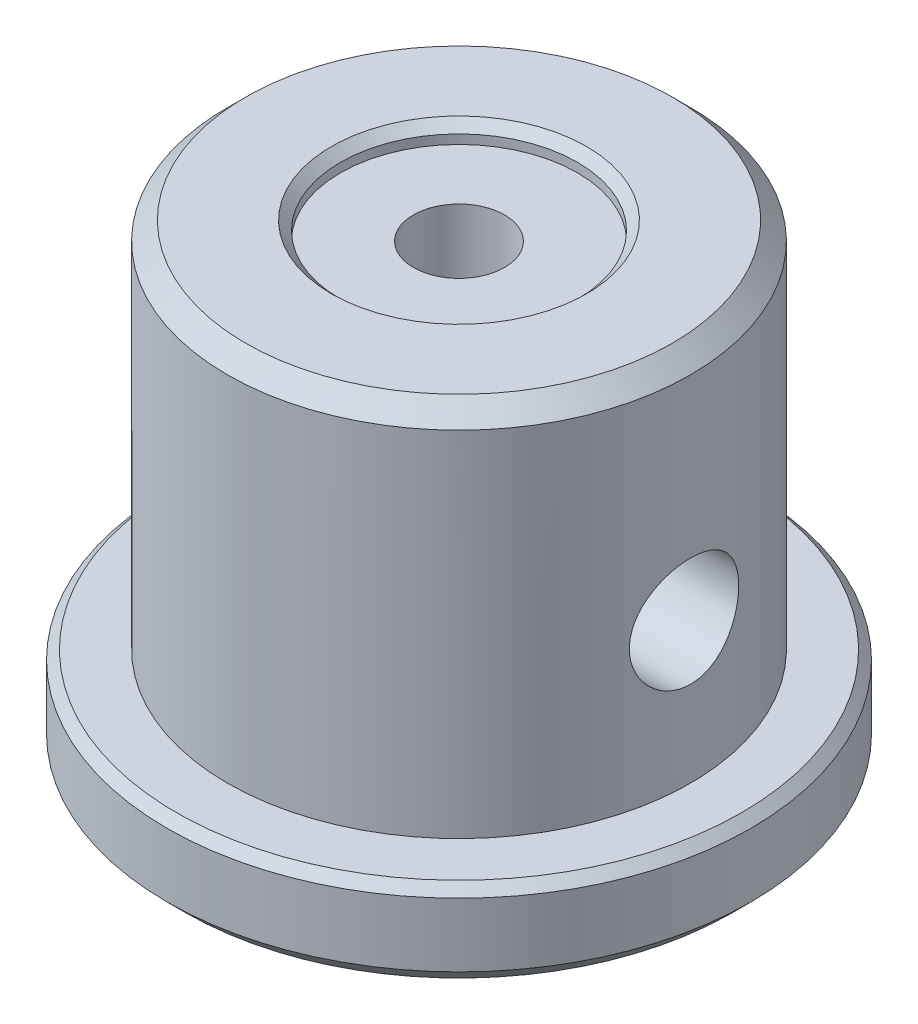
ISO-10303-21;
HEADER;
FILE_DESCRIPTION(('STEP AP214'),'2;1');
FILE_NAME('part.step','',(''),(''),'','','');
FILE_SCHEMA(('AUTOMOTIVE_DESIGN { 1 0 10303 214 1 1 1 1 }'));
ENDSEC;
DATA;
#1=APPLICATION_CONTEXT('core data for automotive mechanical design processes');
#2=APPLICATION_PROTOCOL_DEFINITION('international standard','automotive_design',2000,#1);
#3=PRODUCT_CONTEXT('',#1,'mechanical');
#4=PRODUCT('Part','Part','',(#3));
#5=PRODUCT_RELATED_PRODUCT_CATEGORY('part','',(#4));
#6=PRODUCT_DEFINITION_FORMATION('','',#4);
#7=PRODUCT_DEFINITION_CONTEXT('part definition',#1,'design');
#8=PRODUCT_DEFINITION('design','',#6,#7);
#9=PRODUCT_DEFINITION_SHAPE('','',#8);
#10=(LENGTH_UNIT() NAMED_UNIT(*) SI_UNIT(.MILLI.,.METRE.));
#11=(NAMED_UNIT(*) PLANE_ANGLE_UNIT() SI_UNIT($,.RADIAN.));
#12=(NAMED_UNIT(*) SI_UNIT($,.STERADIAN.) SOLID_ANGLE_UNIT());
#13=UNCERTAINTY_MEASURE_WITH_UNIT(LENGTH_MEASURE(1.E-05),#10,'distance_accuracy_value','');
#14=(GEOMETRIC_REPRESENTATION_CONTEXT(3) GLOBAL_UNCERTAINTY_ASSIGNED_CONTEXT((#13)) GLOBAL_UNIT_ASSIGNED_CONTEXT((#10,
#11,#12)) REPRESENTATION_CONTEXT('',''));
#15=CARTESIAN_POINT('',(0.,0.,0.));
#16=DIRECTION('',(0.,0.,1.));
#17=DIRECTION('',(1.,0.,0.));
#18=AXIS2_PLACEMENT_3D('',#15,#16,#17);
#19=CARTESIAN_POINT('',(0.,-11.7,0.));
#20=DIRECTION('',(0.,-1.,0.));
#21=DIRECTION('',(0.,0.,-1.));
#22=AXIS2_PLACEMENT_3D('',#19,#20,#21);
#23=CYLINDRICAL_SURFACE('',#22,2.5);
#24=CARTESIAN_POINT('',(0.,-1.6583123951777,-2.5));
#25=CARTESIAN_POINT('',(-0.088304410185564,-1.65832848527777,-2.49999381779257));
#26=CARTESIAN_POINT('',(-0.176759786009825,-1.6655210686776,-2.49526266006824));
#27=CARTESIAN_POINT('',(-0.35077788390269,-1.69279627564258,-2.47682990119872));
#28=CARTESIAN_POINT('',(-0.436329599685066,-1.71292318814634,-2.46309747522165));
#29=CARTESIAN_POINT('',(-0.635105310642334,-1.7723311567861,-2.42086856120701));
#30=CARTESIAN_POINT('',(-0.746191654487405,-1.81601359579225,-2.38871146123827));
#31=CARTESIAN_POINT('',(-0.959177816575186,-1.91336767201443,-2.31147102501776));
#32=CARTESIAN_POINT('',(-1.061046484653,-1.96707143083862,-2.26634586338956));
#33=CARTESIAN_POINT('',(-1.22904561401217,-2.0633128033891,-2.1784743531554));
#34=CARTESIAN_POINT('',(-1.29726159135526,-2.10482488185012,-2.1385289521929));
#35=CARTESIAN_POINT('',(-1.42928710039742,-2.18866644492365,-2.05264418187203));
#36=CARTESIAN_POINT('',(-1.49309472073759,-2.23099627404094,-2.00670223718894));
#37=CARTESIAN_POINT('',(-1.6777567676036,-2.35727388143592,-1.86006177209498));
#38=CARTESIAN_POINT('',(-1.79213663242395,-2.44068431676979,-1.75039822318641));
#39=CARTESIAN_POINT('',(-1.97859400578864,-2.58108364411647,-1.53331236095276));
#40=CARTESIAN_POINT('',(-2.05449822257982,-2.63992409122052,-1.43034863494402));
#41=CARTESIAN_POINT('',(-2.1913370573922,-2.74775790284001,-1.2102730649704));
#42=CARTESIAN_POINT('',(-2.25229592151062,-2.79676719280152,-1.0931846025589));
#43=CARTESIAN_POINT('',(-2.34711286507275,-2.8737292379046,-0.867930574105452));
#44=CARTESIAN_POINT('',(-2.38383396465568,-2.90385730730848,-0.761720558967916));
#45=CARTESIAN_POINT('',(-2.44298040968634,-2.9526038261635,-0.542834165009171));
#46=CARTESIAN_POINT('',(-2.46541399390808,-2.97122890852624,-0.430161553726257));
#47=CARTESIAN_POINT('',(-2.49460149564534,-2.99549160197878,-0.200906197669826));
#48=CARTESIAN_POINT('',(-2.50128982974754,-3.00107488956406,-0.0843091426465968));
#49=CARTESIAN_POINT('',(-2.4982977548847,-2.99858143529682,0.148527393661064));
#50=CARTESIAN_POINT('',(-2.48861770853832,-2.99050499605651,0.264766882809716));
#51=CARTESIAN_POINT('',(-2.45478575045629,-2.96241335973365,0.485446031322613));
#52=CARTESIAN_POINT('',(-2.43164888215418,-2.9432359451617,0.590154005534434));
#53=CARTESIAN_POINT('',(-2.37305216876755,-2.89501312358898,0.793626256853986));
#54=CARTESIAN_POINT('',(-2.33759055594486,-2.86596630103235,0.892389678949309));
#55=CARTESIAN_POINT('',(-2.25240882854878,-2.79690305459733,1.09053364635439));
#56=CARTESIAN_POINT('',(-2.20172823083574,-2.7561606192345,1.18924374927733));
#57=CARTESIAN_POINT('',(-2.08960330706299,-2.66744762527376,1.37677917974558));
#58=CARTESIAN_POINT('',(-2.02814930658852,-2.61947057552121,1.46559550453314));
#59=CARTESIAN_POINT('',(-1.86454067552574,-2.4944878939135,1.67280381279727));
#60=CARTESIAN_POINT('',(-1.75692877660215,-2.41452783856826,1.78517417530476));
#61=CARTESIAN_POINT('',(-1.58275969727699,-2.29203945368863,1.93670187620853));
#62=CARTESIAN_POINT('',(-1.522485831693,-2.25072631897241,1.98442734415742));
#63=CARTESIAN_POINT('',(-1.39772821451073,-2.16828375986482,2.07418694298424));
#64=CARTESIAN_POINT('',(-1.33324598900508,-2.12715427459339,2.11622312017878));
#65=CARTESIAN_POINT('',(-1.16888139552588,-2.02736013921577,2.21282833126485));
#66=CARTESIAN_POINT('',(-1.06653640056607,-1.96948181658004,2.26407571910762));
#67=CARTESIAN_POINT('',(-0.852138828462755,-1.86213853666711,2.35314050085765));
#68=CARTESIAN_POINT('',(-0.740114944373146,-1.81264991817824,2.39099600305927));
#69=CARTESIAN_POINT('',(-0.544179547487996,-1.74376607660709,2.4414108954061));
#70=CARTESIAN_POINT('',(-0.463001249716639,-1.71981949257405,2.45819358164965));
#71=CARTESIAN_POINT('',(-0.297038854325257,-1.68277668804568,2.48370273222149));
#72=CARTESIAN_POINT('',(-0.212263731105008,-1.66965496020135,2.49244814091896));
#73=CARTESIAN_POINT('',(-0.0405722934295429,-1.65659310081955,2.50115517387014));
#74=CARTESIAN_POINT('',(0.0463550146674118,-1.65674814862693,2.5010533736449));
#75=CARTESIAN_POINT('',(0.218705687513545,-1.67045143445787,2.49191597272525));
#76=CARTESIAN_POINT('',(0.304126803130151,-1.68401821733787,2.48286800185718));
#77=CARTESIAN_POINT('',(0.492184457339049,-1.7267988603849,2.45336046117379));
#78=CARTESIAN_POINT('',(0.593724968504624,-1.75909755109212,2.43059717464989));
#79=CARTESIAN_POINT('',(0.789632446399401,-1.83446297156782,2.37422567983509));
#80=CARTESIAN_POINT('',(0.883974414692776,-1.87756517999229,2.34058163140775));
#81=CARTESIAN_POINT('',(1.04599478329327,-1.95968409590129,2.27197464095645));
#82=CARTESIAN_POINT('',(1.11504573974773,-1.99758766640253,2.23884949579965));
#83=CARTESIAN_POINT('',(1.24902849720757,-2.07535316303084,2.16695951166941));
#84=CARTESIAN_POINT('',(1.31395814627361,-2.11521609327316,2.12819176063911));
#85=CARTESIAN_POINT('',(1.43983390582655,-2.19562728957069,2.04513177456922));
#86=CARTESIAN_POINT('',(1.50077670076393,-2.23617609161424,2.00083502832488));
#87=CARTESIAN_POINT('',(1.61858494910054,-2.31689068931587,1.90679633939304));
#88=CARTESIAN_POINT('',(1.67544826221828,-2.3570562744781,1.85705157250686));
#89=CARTESIAN_POINT('',(1.842454835183,-2.47761126043941,1.69691470794631));
#90=CARTESIAN_POINT('',(1.94593753871942,-2.55601135420397,1.57762869702065));
#91=CARTESIAN_POINT('',(2.08472063306061,-2.66368994822279,1.38213833429724));
#92=CARTESIAN_POINT('',(2.12821052951402,-2.69790353664307,1.3142814425198));
#93=CARTESIAN_POINT('',(2.20911674103365,-2.76217044277537,1.17320567310927));
#94=CARTESIAN_POINT('',(2.24653665115328,-2.79222622145722,1.09999000687015));
#95=CARTESIAN_POINT('',(2.32591734964354,-2.85642765987167,0.923231349702331));
#96=CARTESIAN_POINT('',(2.36521682406638,-2.88858366145246,0.817729906619421));
#97=CARTESIAN_POINT('',(2.42963624825053,-2.94156350531484,0.599797532910353));
#98=CARTESIAN_POINT('',(2.45476723543845,-2.96239616816155,0.487372072128383));
#99=CARTESIAN_POINT('',(2.48937715184511,-2.99113754779354,0.257904014589447));
#100=CARTESIAN_POINT('',(2.49878071508354,-2.99898403281667,0.140841922250429));
#101=CARTESIAN_POINT('',(2.50099563152832,-3.00082959064104,-0.0935504369182196));
#102=CARTESIAN_POINT('',(2.49380819649052,-2.99482967474112,-0.21088068353741));
#103=CARTESIAN_POINT('',(2.46450495298087,-2.97047572120601,-0.433478999214015));
#104=CARTESIAN_POINT('',(2.44351396324128,-2.95305281328287,-0.539003381840972));
#105=CARTESIAN_POINT('',(2.38895614773621,-2.9080705750889,-0.744442226622882));
#106=CARTESIAN_POINT('',(2.35538735536287,-2.88050965969777,-0.844355808688068));
#107=CARTESIAN_POINT('',(2.27438284471799,-2.81464343863442,-1.0438405515299));
#108=CARTESIAN_POINT('',(2.22611822789529,-2.77570403743571,-1.1428617285401));
#109=CARTESIAN_POINT('',(2.11879506711647,-2.69039800671957,-1.33135097301228));
#110=CARTESIAN_POINT('',(2.05972820092707,-2.6440256541589,-1.42081159008167));
#111=CARTESIAN_POINT('',(1.90195625237425,-2.52264851028665,-1.63002558091946));
#112=CARTESIAN_POINT('',(1.79777364325114,-2.44452820472334,-1.74390511945051));
#113=CARTESIAN_POINT('',(1.62884627072377,-2.32413331941839,-1.89807730985019));
#114=CARTESIAN_POINT('',(1.57032869950185,-2.28340098508491,-1.94675534900063));
#115=CARTESIAN_POINT('',(1.44915853027402,-2.20183068446821,-2.03855478653209));
#116=CARTESIAN_POINT('',(1.38650721384265,-2.16099275466,-2.08167789496707));
#117=CARTESIAN_POINT('',(1.22050831148748,-2.05749735800433,-2.18509588569703));
#118=CARTESIAN_POINT('',(1.11415765165371,-1.99554062285107,-2.24133685872228));
#119=CARTESIAN_POINT('',(0.890744315289479,-1.8799763526203,-2.33909634990328));
#120=CARTESIAN_POINT('',(0.773711928944043,-1.82634630603961,-2.38065496503422));
#121=CARTESIAN_POINT('',(0.570125763537391,-1.75197107121731,-2.43556494992112));
#122=CARTESIAN_POINT('',(0.486726207798392,-1.72624379189026,-2.4537026175718));
#123=CARTESIAN_POINT('',(0.315972131174008,-1.68613426001934,-2.48144437754558));
#124=CARTESIAN_POINT('',(0.228634203067296,-1.67170839549487,-2.49108129246948));
#125=CARTESIAN_POINT('',(0.117208675186534,-1.66228358000323,-2.49736160836694));
#126=CARTESIAN_POINT('',(0.0938071751244114,-1.66079886805539,-2.49834926640805));
#127=CARTESIAN_POINT('',(0.0469406806078007,-1.65881104526667,-2.49966934514013));
#128=CARTESIAN_POINT('',(0.023475675120653,-1.65830811763413,-2.50000164353618));
#129=CARTESIAN_POINT('',(0.,-1.6583123951777,-2.5));
#130=B_SPLINE_CURVE_WITH_KNOTS('',3,(#24,#25,#26,#27,#28,#29,#30,#31,#32,#33,#34,#35,#36,#37,
#38,#39,#40,#41,#42,#43,#44,#45,#46,#47,#48,#49,#50,#51,#52,#53,#54,#55,#56,#57,#58,#59,#60,#61,
#62,#63,#64,#65,#66,#67,#68,#69,#70,#71,#72,#73,#74,#75,#76,#77,#78,#79,#80,#81,#82,#83,#84,#85,
#86,#87,#88,#89,#90,#91,#92,#93,#94,#95,#96,#97,#98,#99,#100,#101,#102,#103,#104,#105,#106,#107,
#108,#109,#110,#111,#112,#113,#114,#115,#116,#117,#118,#119,#120,#121,#122,#123,#124,#125,#126,
#127,#128,#129),.UNSPECIFIED.,.T.,.F.,(4,2,2,2,2,2,2,2,2,2,2,2,2,2,2,2,2,2,2,2,2,2,2,2,2,2,2,2,
2,2,2,2,2,2,2,2,2,2,2,2,2,2,2,2,2,2,2,2,2,2,2,2,4),(0.,0.264807486843959,0.530526577859134,
0.899311711113916,1.26929988428696,1.53684271887073,1.80450083499513,2.33872733232382,
2.75963734355716,3.17985991852652,3.52745225260399,3.87484396861114,4.22368012855136,
4.57250856061374,4.89792180788527,5.22338174845522,5.57669292749804,5.93032301720748,
6.45212646169812,6.71375344417634,6.97528607349791,7.35902155845295,7.74165612186457,
7.99961659145731,8.25696746076718,8.51616339578941,8.77571823174391,9.10077852677668,
9.42692063321701,9.6829620521776,9.9391360815788,10.1955205112228,10.4520384827407,
10.9775613091595,11.2398627749287,11.502008316419,11.8517559716833,12.201230791394,
12.5523755496757,12.903494662228,13.2290536025831,13.5546634671053,13.903879771412,
14.2533662599301,14.7693582552691,15.0281495003973,15.2868608867407,15.691662084526,
16.0953490806584,16.3618811606764,16.6273795605045,16.697765340701,16.7681642541596),.UNSPECIFIED.);
#131=CARTESIAN_POINT('',(0.,-1.6583123951777,-2.5));
#132=VERTEX_POINT('',#131);
#133=EDGE_CURVE('E86',#132,#132,#130,.T.);
#134=ORIENTED_EDGE('',*,*,#133,.T.);
#135=EDGE_LOOP('',(#134));
#136=FACE_BOUND('',#135,.T.);
#137=CARTESIAN_POINT('',(0.,-11.7,0.));
#138=DIRECTION('',(0.,-1.,0.));
#139=DIRECTION('',(0.,0.,-1.));
#140=AXIS2_PLACEMENT_3D('',#137,#138,#139);
#141=CIRCLE('',#140,2.5);
#142=CARTESIAN_POINT('',(0.,-11.7,-2.5));
#143=VERTEX_POINT('',#142);
#144=EDGE_CURVE('E84',#143,#143,#141,.T.);
#145=ORIENTED_EDGE('',*,*,#144,.T.);
#146=EDGE_LOOP('',(#145));
#147=FACE_BOUND('',#146,.T.);
#148=ADVANCED_FACE('F34',(#136,#147),#23,.F.);
#149=CARTESIAN_POINT('',(0.,-11.7,0.));
#150=DIRECTION('',(0.,1.,0.));
#151=DIRECTION('',(0.,0.,1.));
#152=AXIS2_PLACEMENT_3D('',#149,#150,#151);
#153=PLANE('',#152);
#154=CARTESIAN_POINT('',(0.,-11.7,0.));
#155=DIRECTION('',(0.,-1.,0.));
#156=DIRECTION('',(0.,0.,-1.));
#157=AXIS2_PLACEMENT_3D('',#154,#155,#156);
#158=CIRCLE('',#157,9.00000000000001);
#159=CARTESIAN_POINT('',(0.,-11.7,-9.00000000000001));
#160=VERTEX_POINT('',#159);
#161=EDGE_CURVE('E81',#160,#160,#158,.T.);
#162=ORIENTED_EDGE('',*,*,#161,.T.);
#163=EDGE_LOOP('',(#162));
#164=FACE_BOUND('',#163,.T.);
#165=ORIENTED_EDGE('',*,*,#144,.F.);
#166=EDGE_LOOP('',(#165));
#167=FACE_BOUND('',#166,.T.);
#168=ADVANCED_FACE('F120',(#164,#167),#153,.F.);
#169=CARTESIAN_POINT('',(0.,-12.2,0.));
#170=DIRECTION('',(0.,-1.,0.));
#171=DIRECTION('',(0.,0.,-1.));
#172=AXIS2_PLACEMENT_3D('',#169,#170,#171);
#173=CONICAL_SURFACE('',#172,9.50000000000001,0.78539816339745);
#174=ORIENTED_EDGE('',*,*,#161,.F.);
#175=EDGE_LOOP('',(#174));
#176=FACE_BOUND('',#175,.T.);
#177=CARTESIAN_POINT('',(0.,-12.2,0.));
#178=DIRECTION('',(0.,1.,0.));
#179=DIRECTION('',(0.,0.,1.));
#180=AXIS2_PLACEMENT_3D('',#177,#178,#179);
#181=CIRCLE('',#180,9.50000000000001);
#182=CARTESIAN_POINT('',(0.,-12.2,9.50000000000001));
#183=VERTEX_POINT('',#182);
#184=EDGE_CURVE('E80',#183,#183,#181,.F.);
#185=ORIENTED_EDGE('',*,*,#184,.T.);
#186=EDGE_LOOP('',(#185));
#187=FACE_BOUND('',#186,.T.);
#188=ADVANCED_FACE('F116',(#176,#187),#173,.F.);
#189=CARTESIAN_POINT('',(0.,11.7,0.));
#190=DIRECTION('',(0.,1.,0.));
#191=DIRECTION('',(0.,0.,1.));
#192=AXIS2_PLACEMENT_3D('',#189,#190,#191);
#193=CYLINDRICAL_SURFACE('',#192,2.5);
#194=CARTESIAN_POINT('',(0.,1.6583123951777,2.5));
#195=CARTESIAN_POINT('',(-0.088304410185564,1.65832848527777,2.49999381779257));
#196=CARTESIAN_POINT('',(-0.176759786009825,1.6655210686776,2.49526266006824));
#197=CARTESIAN_POINT('',(-0.35077788390269,1.69279627564258,2.47682990119872));
#198=CARTESIAN_POINT('',(-0.436329599685066,1.71292318814634,2.46309747522165));
#199=CARTESIAN_POINT('',(-0.635105310642334,1.7723311567861,2.42086856120701));
#200=CARTESIAN_POINT('',(-0.746191654487405,1.81601359579225,2.38871146123827));
#201=CARTESIAN_POINT('',(-0.959177816575186,1.91336767201443,2.31147102501776));
#202=CARTESIAN_POINT('',(-1.061046484653,1.96707143083862,2.26634586338956));
#203=CARTESIAN_POINT('',(-1.22904561401217,2.0633128033891,2.1784743531554));
#204=CARTESIAN_POINT('',(-1.29726159135526,2.10482488185012,2.1385289521929));
#205=CARTESIAN_POINT('',(-1.42928710039742,2.18866644492365,2.05264418187203));
#206=CARTESIAN_POINT('',(-1.49309472073759,2.23099627404094,2.00670223718894));
#207=CARTESIAN_POINT('',(-1.6777567676036,2.35727388143592,1.86006177209498));
#208=CARTESIAN_POINT('',(-1.79213663242395,2.44068431676979,1.75039822318641));
#209=CARTESIAN_POINT('',(-1.97859400578864,2.58108364411647,1.53331236095276));
#210=CARTESIAN_POINT('',(-2.05449822257982,2.63992409122052,1.43034863494402));
#211=CARTESIAN_POINT('',(-2.1913370573922,2.74775790284001,1.2102730649704));
#212=CARTESIAN_POINT('',(-2.25229592151062,2.79676719280152,1.0931846025589));
#213=CARTESIAN_POINT('',(-2.34711286507275,2.8737292379046,0.867930574105452));
#214=CARTESIAN_POINT('',(-2.38383396465568,2.90385730730848,0.761720558967916));
#215=CARTESIAN_POINT('',(-2.44298040968634,2.9526038261635,0.542834165009171));
#216=CARTESIAN_POINT('',(-2.46541399390808,2.97122890852624,0.430161553726257));
#217=CARTESIAN_POINT('',(-2.49460149564534,2.99549160197878,0.200906197669826));
#218=CARTESIAN_POINT('',(-2.50128982974754,3.00107488956406,0.0843091426465968));
#219=CARTESIAN_POINT('',(-2.4982977548847,2.99858143529682,-0.148527393661064));
#220=CARTESIAN_POINT('',(-2.48861770853832,2.99050499605651,-0.264766882809716));
#221=CARTESIAN_POINT('',(-2.45478575045629,2.96241335973365,-0.485446031322613));
#222=CARTESIAN_POINT('',(-2.43164888215418,2.9432359451617,-0.590154005534434));
#223=CARTESIAN_POINT('',(-2.37305216876755,2.89501312358898,-0.793626256853986));
#224=CARTESIAN_POINT('',(-2.33759055594486,2.86596630103235,-0.892389678949309));
#225=CARTESIAN_POINT('',(-2.25240882854878,2.79690305459733,-1.09053364635439));
#226=CARTESIAN_POINT('',(-2.20172823083574,2.7561606192345,-1.18924374927733));
#227=CARTESIAN_POINT('',(-2.08960330706299,2.66744762527376,-1.37677917974558));
#228=CARTESIAN_POINT('',(-2.02814930658852,2.61947057552121,-1.46559550453314));
#229=CARTESIAN_POINT('',(-1.86454067552574,2.4944878939135,-1.67280381279727));
#230=CARTESIAN_POINT('',(-1.75692877660215,2.41452783856826,-1.78517417530476));
#231=CARTESIAN_POINT('',(-1.58275969727699,2.29203945368863,-1.93670187620853));
#232=CARTESIAN_POINT('',(-1.522485831693,2.25072631897241,-1.98442734415742));
#233=CARTESIAN_POINT('',(-1.39772821451073,2.16828375986482,-2.07418694298424));
#234=CARTESIAN_POINT('',(-1.33324598900508,2.12715427459339,-2.11622312017878));
#235=CARTESIAN_POINT('',(-1.16888139552588,2.02736013921577,-2.21282833126485));
#236=CARTESIAN_POINT('',(-1.06653640056607,1.96948181658004,-2.26407571910762));
#237=CARTESIAN_POINT('',(-0.852138828462755,1.86213853666711,-2.35314050085765));
#238=CARTESIAN_POINT('',(-0.740114944373146,1.81264991817824,-2.39099600305927));
#239=CARTESIAN_POINT('',(-0.544179547487996,1.74376607660709,-2.4414108954061));
#240=CARTESIAN_POINT('',(-0.463001249716639,1.71981949257405,-2.45819358164965));
#241=CARTESIAN_POINT('',(-0.297038854325257,1.68277668804568,-2.48370273222149));
#242=CARTESIAN_POINT('',(-0.212263731105008,1.66965496020135,-2.49244814091896));
#243=CARTESIAN_POINT('',(-0.0405722934295429,1.65659310081955,-2.50115517387014));
#244=CARTESIAN_POINT('',(0.0463550146674118,1.65674814862693,-2.5010533736449));
#245=CARTESIAN_POINT('',(0.218705687513545,1.67045143445787,-2.49191597272525));
#246=CARTESIAN_POINT('',(0.304126803130151,1.68401821733787,-2.48286800185718));
#247=CARTESIAN_POINT('',(0.492184457339049,1.7267988603849,-2.45336046117379));
#248=CARTESIAN_POINT('',(0.593724968504624,1.75909755109212,-2.43059717464989));
#249=CARTESIAN_POINT('',(0.789632446399401,1.83446297156782,-2.37422567983509));
#250=CARTESIAN_POINT('',(0.883974414692776,1.87756517999229,-2.34058163140775));
#251=CARTESIAN_POINT('',(1.04599478329327,1.95968409590129,-2.27197464095645));
#252=CARTESIAN_POINT('',(1.11504573974773,1.99758766640253,-2.23884949579965));
#253=CARTESIAN_POINT('',(1.24902849720757,2.07535316303084,-2.16695951166941));
#254=CARTESIAN_POINT('',(1.31395814627361,2.11521609327316,-2.12819176063911));
#255=CARTESIAN_POINT('',(1.43983390582655,2.19562728957069,-2.04513177456922));
#256=CARTESIAN_POINT('',(1.50077670076393,2.23617609161424,-2.00083502832488));
#257=CARTESIAN_POINT('',(1.61858494910054,2.31689068931587,-1.90679633939304));
#258=CARTESIAN_POINT('',(1.67544826221828,2.3570562744781,-1.85705157250686));
#259=CARTESIAN_POINT('',(1.842454835183,2.47761126043941,-1.69691470794631));
#260=CARTESIAN_POINT('',(1.94593753871942,2.55601135420397,-1.57762869702065));
#261=CARTESIAN_POINT('',(2.08472063306061,2.66368994822279,-1.38213833429724));
#262=CARTESIAN_POINT('',(2.12821052951402,2.69790353664307,-1.3142814425198));
#263=CARTESIAN_POINT('',(2.20911674103365,2.76217044277537,-1.17320567310927));
#264=CARTESIAN_POINT('',(2.24653665115328,2.79222622145722,-1.09999000687015));
#265=CARTESIAN_POINT('',(2.32591734964354,2.85642765987167,-0.923231349702331));
#266=CARTESIAN_POINT('',(2.36521682406638,2.88858366145246,-0.817729906619421));
#267=CARTESIAN_POINT('',(2.42963624825053,2.94156350531484,-0.599797532910353));
#268=CARTESIAN_POINT('',(2.45476723543845,2.96239616816155,-0.487372072128383));
#269=CARTESIAN_POINT('',(2.48937715184511,2.99113754779354,-0.257904014589447));
#270=CARTESIAN_POINT('',(2.49878071508354,2.99898403281667,-0.140841922250429));
#271=CARTESIAN_POINT('',(2.50099563152832,3.00082959064104,0.0935504369182196));
#272=CARTESIAN_POINT('',(2.49380819649052,2.99482967474112,0.21088068353741));
#273=CARTESIAN_POINT('',(2.46450495298087,2.97047572120601,0.433478999214015));
#274=CARTESIAN_POINT('',(2.44351396324128,2.95305281328287,0.539003381840972));
#275=CARTESIAN_POINT('',(2.38895614773621,2.9080705750889,0.744442226622882));
#276=CARTESIAN_POINT('',(2.35538735536287,2.88050965969777,0.844355808688068));
#277=CARTESIAN_POINT('',(2.27438284471799,2.81464343863442,1.0438405515299));
#278=CARTESIAN_POINT('',(2.22611822789529,2.77570403743571,1.1428617285401));
#279=CARTESIAN_POINT('',(2.11879506711647,2.69039800671957,1.33135097301228));
#280=CARTESIAN_POINT('',(2.05972820092707,2.6440256541589,1.42081159008167));
#281=CARTESIAN_POINT('',(1.90195625237425,2.52264851028665,1.63002558091946));
#282=CARTESIAN_POINT('',(1.79777364325114,2.44452820472334,1.74390511945051));
#283=CARTESIAN_POINT('',(1.62884627072377,2.32413331941839,1.89807730985019));
#284=CARTESIAN_POINT('',(1.57032869950185,2.28340098508491,1.94675534900063));
#285=CARTESIAN_POINT('',(1.44915853027402,2.20183068446821,2.03855478653209));
#286=CARTESIAN_POINT('',(1.38650721384265,2.16099275466,2.08167789496707));
#287=CARTESIAN_POINT('',(1.22050831148748,2.05749735800433,2.18509588569703));
#288=CARTESIAN_POINT('',(1.11415765165371,1.99554062285107,2.24133685872228));
#289=CARTESIAN_POINT('',(0.890744315289479,1.8799763526203,2.33909634990328));
#290=CARTESIAN_POINT('',(0.773711928944043,1.82634630603961,2.38065496503422));
#291=CARTESIAN_POINT('',(0.570125763537391,1.75197107121731,2.43556494992112));
#292=CARTESIAN_POINT('',(0.486726207798392,1.72624379189026,2.4537026175718));
#293=CARTESIAN_POINT('',(0.315972131174008,1.68613426001934,2.48144437754558));
#294=CARTESIAN_POINT('',(0.228634203067296,1.67170839549487,2.49108129246948));
#295=CARTESIAN_POINT('',(0.117208675186534,1.66228358000323,2.49736160836694));
#296=CARTESIAN_POINT('',(0.0938071751244114,1.66079886805539,2.49834926640805));
#297=CARTESIAN_POINT('',(0.0469406806078007,1.65881104526667,2.49966934514013));
#298=CARTESIAN_POINT('',(0.023475675120653,1.65830811763413,2.50000164353618));
#299=CARTESIAN_POINT('',(0.,1.6583123951777,2.5));
#300=B_SPLINE_CURVE_WITH_KNOTS('',3,(#194,#195,#196,#197,#198,#199,#200,#201,#202,#203,#204,
#205,#206,#207,#208,#209,#210,#211,#212,#213,#214,#215,#216,#217,#218,#219,#220,#221,#222,#223,
#224,#225,#226,#227,#228,#229,#230,#231,#232,#233,#234,#235,#236,#237,#238,#239,#240,#241,#242,
#243,#244,#245,#246,#247,#248,#249,#250,#251,#252,#253,#254,#255,#256,#257,#258,#259,#260,#261,
#262,#263,#264,#265,#266,#267,#268,#269,#270,#271,#272,#273,#274,#275,#276,#277,#278,#279,#280,
#281,#282,#283,#284,#285,#286,#287,#288,#289,#290,#291,#292,#293,#294,#295,#296,#297,#298,#299),
.UNSPECIFIED.,.T.,.F.,(4,2,2,2,2,2,2,2,2,2,2,2,2,2,2,2,2,2,2,2,2,2,2,2,2,2,2,2,2,2,2,2,2,2,2,2,
2,2,2,2,2,2,2,2,2,2,2,2,2,2,2,2,4),(0.,0.264807486843959,0.530526577859134,0.899311711113916,
1.26929988428696,1.53684271887073,1.80450083499513,2.33872733232382,2.75963734355716,
3.17985991852652,3.52745225260399,3.87484396861114,4.22368012855136,4.57250856061374,
4.89792180788527,5.22338174845522,5.57669292749804,5.93032301720748,6.45212646169812,
6.71375344417634,6.97528607349791,7.35902155845295,7.74165612186457,7.99961659145731,
8.25696746076718,8.51616339578941,8.77571823174391,9.10077852677668,9.42692063321701,
9.6829620521776,9.9391360815788,10.1955205112228,10.4520384827407,10.9775613091595,
11.2398627749287,11.502008316419,11.8517559716833,12.201230791394,12.5523755496757,
12.903494662228,13.2290536025831,13.5546634671053,13.903879771412,14.2533662599301,
14.7693582552691,15.0281495003973,15.2868608867407,15.691662084526,16.0953490806584,
16.3618811606764,16.6273795605045,16.697765340701,16.7681642541596),.UNSPECIFIED.);
#301=CARTESIAN_POINT('',(0.,1.6583123951777,2.5));
#302=VERTEX_POINT('',#301);
#303=EDGE_CURVE('E103',#302,#302,#300,.T.);
#304=ORIENTED_EDGE('',*,*,#303,.T.);
#305=EDGE_LOOP('',(#304));
#306=FACE_BOUND('',#305,.T.);
#307=CARTESIAN_POINT('',(0.,11.7,0.));
#308=DIRECTION('',(0.,1.,0.));
#309=DIRECTION('',(0.,0.,1.));
#310=AXIS2_PLACEMENT_3D('',#307,#308,#309);
#311=CIRCLE('',#310,2.5);
#312=CARTESIAN_POINT('',(0.,11.7,2.5));
#313=VERTEX_POINT('',#312);
#314=EDGE_CURVE('E77',#313,#313,#311,.T.);
#315=ORIENTED_EDGE('',*,*,#314,.T.);
#316=EDGE_LOOP('',(#315));
#317=FACE_BOUND('',#316,.T.);
#318=ADVANCED_FACE('F110',(#306,#317),#193,.F.);
#319=CARTESIAN_POINT('',(0.,26.5038387670979,0.));
#320=DIRECTION('',(0.,1.,0.));
#321=DIRECTION('',(0.,0.,1.));
#322=AXIS2_PLACEMENT_3D('',#319,#320,#321);
#323=CYLINDRICAL_SURFACE('',#322,9.50000000000001);
#324=ORIENTED_EDGE('',*,*,#184,.F.);
#325=EDGE_LOOP('',(#324));
#326=FACE_BOUND('',#325,.T.);
#327=CARTESIAN_POINT('',(0.,-12.7,0.));
#328=DIRECTION('',(0.,1.,0.));
#329=DIRECTION('',(0.,0.,1.));
#330=AXIS2_PLACEMENT_3D('',#327,#328,#329);
#331=CIRCLE('',#330,9.50000000000001);
#332=CARTESIAN_POINT('',(0.,-12.7,9.50000000000001));
#333=VERTEX_POINT('',#332);
#334=EDGE_CURVE('E74',#333,#333,#331,.F.);
#335=ORIENTED_EDGE('',*,*,#334,.T.);
#336=EDGE_LOOP('',(#335));
#337=FACE_BOUND('',#336,.T.);
#338=ADVANCED_FACE('F115',(#326,#337),#323,.F.);
#339=CARTESIAN_POINT('',(6.5,11.7,0.));
#340=DIRECTION('',(0.,-1.,0.));
#341=DIRECTION('',(0.,0.,-1.));
#342=AXIS2_PLACEMENT_3D('',#339,#340,#341);
#343=PLANE('',#342);
#344=CARTESIAN_POINT('',(0.,11.7,0.));
#345=DIRECTION('',(0.,1.,0.));
#346=DIRECTION('',(0.,0.,1.));
#347=AXIS2_PLACEMENT_3D('',#344,#345,#346);
#348=CIRCLE('',#347,6.5);
#349=CARTESIAN_POINT('',(0.,11.7,6.5));
#350=VERTEX_POINT('',#349);
#351=EDGE_CURVE('E71',#350,#350,#348,.T.);
#352=ORIENTED_EDGE('',*,*,#351,.T.);
#353=EDGE_LOOP('',(#352));
#354=FACE_BOUND('',#353,.T.);
#355=ORIENTED_EDGE('',*,*,#314,.F.);
#356=EDGE_LOOP('',(#355));
#357=FACE_BOUND('',#356,.T.);
#358=ADVANCED_FACE('F178',(#354,#357),#343,.F.);
#359=CARTESIAN_POINT('',(9.5,-12.7,0.));
#360=DIRECTION('',(0.,1.,0.));
#361=DIRECTION('',(0.,0.,1.));
#362=AXIS2_PLACEMENT_3D('',#359,#360,#361);
#363=PLANE('',#362);
#364=ORIENTED_EDGE('',*,*,#334,.F.);
#365=EDGE_LOOP('',(#364));
#366=FACE_BOUND('',#365,.T.);
#367=CARTESIAN_POINT('',(0.,-12.7,0.));
#368=DIRECTION('',(0.,1.,0.));
#369=DIRECTION('',(0.,0.,1.));
#370=AXIS2_PLACEMENT_3D('',#367,#368,#369);
#371=CIRCLE('',#370,15.);
#372=CARTESIAN_POINT('',(0.,-12.7,15.));
#373=VERTEX_POINT('',#372);
#374=EDGE_CURVE('E67',#373,#373,#371,.T.);
#375=ORIENTED_EDGE('',*,*,#374,.F.);
#376=EDGE_LOOP('',(#375));
#377=FACE_BOUND('',#376,.T.);
#378=ADVANCED_FACE('F181',(#366,#377),#363,.F.);
#379=CARTESIAN_POINT('',(0.,26.5038387670979,0.));
#380=DIRECTION('',(0.,1.,0.));
#381=DIRECTION('',(0.,0.,1.));
#382=AXIS2_PLACEMENT_3D('',#379,#380,#381);
#383=CYLINDRICAL_SURFACE('',#382,6.5);
#384=CARTESIAN_POINT('',(0.,12.2,0.));
#385=DIRECTION('',(0.,1.,0.));
#386=DIRECTION('',(0.,0.,1.));
#387=AXIS2_PLACEMENT_3D('',#384,#385,#386);
#388=CIRCLE('',#387,6.5);
#389=CARTESIAN_POINT('',(0.,12.2,6.5));
#390=VERTEX_POINT('',#389);
#391=EDGE_CURVE('E70',#390,#390,#388,.T.);
#392=ORIENTED_EDGE('',*,*,#391,.T.);
#393=EDGE_LOOP('',(#392));
#394=FACE_BOUND('',#393,.T.);
#395=ORIENTED_EDGE('',*,*,#351,.F.);
#396=EDGE_LOOP('',(#395));
#397=FACE_BOUND('',#396,.T.);
#398=ADVANCED_FACE('F184',(#394,#397),#383,.F.);
#399=CARTESIAN_POINT('',(0.,-11.7,0.));
#400=DIRECTION('',(0.,1.,0.));
#401=DIRECTION('',(0.,0.,1.));
#402=AXIS2_PLACEMENT_3D('',#399,#400,#401);
#403=CONICAL_SURFACE('',#402,16.,0.785398163397447);
#404=ORIENTED_EDGE('',*,*,#374,.T.);
#405=EDGE_LOOP('',(#404));
#406=FACE_BOUND('',#405,.T.);
#407=CARTESIAN_POINT('',(0.,-11.7,0.));
#408=DIRECTION('',(0.,1.,0.));
#409=DIRECTION('',(0.,0.,1.));
#410=AXIS2_PLACEMENT_3D('',#407,#408,#409);
#411=CIRCLE('',#410,16.);
#412=CARTESIAN_POINT('',(0.,-11.7,16.));
#413=VERTEX_POINT('',#412);
#414=EDGE_CURVE('E66',#413,#413,#411,.T.);
#415=ORIENTED_EDGE('',*,*,#414,.F.);
#416=EDGE_LOOP('',(#415));
#417=FACE_BOUND('',#416,.T.);
#418=ADVANCED_FACE('F160',(#406,#417),#403,.T.);
#419=CARTESIAN_POINT('',(0.,12.7,0.));
#420=DIRECTION('',(0.,1.,0.));
#421=DIRECTION('',(0.,0.,1.));
#422=AXIS2_PLACEMENT_3D('',#419,#420,#421);
#423=CONICAL_SURFACE('',#422,7.,0.785398163397448);
#424=CARTESIAN_POINT('',(0.,12.7,0.));
#425=DIRECTION('',(0.,1.,0.));
#426=DIRECTION('',(0.,0.,1.));
#427=AXIS2_PLACEMENT_3D('',#424,#425,#426);
#428=CIRCLE('',#427,7.);
#429=CARTESIAN_POINT('',(0.,12.7,7.));
#430=VERTEX_POINT('',#429);
#431=EDGE_CURVE('E63',#430,#430,#428,.T.);
#432=ORIENTED_EDGE('',*,*,#431,.T.);
#433=EDGE_LOOP('',(#432));
#434=FACE_BOUND('',#433,.T.);
#435=ORIENTED_EDGE('',*,*,#391,.F.);
#436=EDGE_LOOP('',(#435));
#437=FACE_BOUND('',#436,.T.);
#438=ADVANCED_FACE('F157',(#434,#437),#423,.F.);
#439=CARTESIAN_POINT('',(0.,26.5038387670979,0.));
#440=DIRECTION('',(0.,1.,0.));
#441=DIRECTION('',(0.,0.,1.));
#442=AXIS2_PLACEMENT_3D('',#439,#440,#441);
#443=CYLINDRICAL_SURFACE('',#442,16.);
#444=ORIENTED_EDGE('',*,*,#414,.T.);
#445=EDGE_LOOP('',(#444));
#446=FACE_BOUND('',#445,.T.);
#447=CARTESIAN_POINT('',(0.,-8.2,0.));
#448=DIRECTION('',(0.,-1.,0.));
#449=DIRECTION('',(0.,0.,-1.));
#450=AXIS2_PLACEMENT_3D('',#447,#448,#449);
#451=CIRCLE('',#450,16.);
#452=CARTESIAN_POINT('',(0.,-8.2,-16.));
#453=VERTEX_POINT('',#452);
#454=EDGE_CURVE('E62',#453,#453,#451,.F.);
#455=ORIENTED_EDGE('',*,*,#454,.F.);
#456=EDGE_LOOP('',(#455));
#457=FACE_BOUND('',#456,.T.);
#458=ADVANCED_FACE('F153',(#446,#457),#443,.T.);
#459=CARTESIAN_POINT('',(11.7,12.7,0.));
#460=DIRECTION('',(0.,-1.,0.));
#461=DIRECTION('',(0.,0.,-1.));
#462=AXIS2_PLACEMENT_3D('',#459,#460,#461);
#463=PLANE('',#462);
#464=CARTESIAN_POINT('',(0.,12.7,0.));
#465=DIRECTION('',(0.,-1.,0.));
#466=DIRECTION('',(1.,0.,0.));
#467=AXIS2_PLACEMENT_3D('',#464,#465,#466);
#468=CIRCLE('',#467,11.7);
#469=CARTESIAN_POINT('',(11.7,12.7,0.));
#470=VERTEX_POINT('',#469);
#471=EDGE_CURVE('E59',#470,#470,#468,.T.);
#472=ORIENTED_EDGE('',*,*,#471,.F.);
#473=EDGE_LOOP('',(#472));
#474=FACE_BOUND('',#473,.T.);
#475=ORIENTED_EDGE('',*,*,#431,.F.);
#476=EDGE_LOOP('',(#475));
#477=FACE_BOUND('',#476,.T.);
#478=ADVANCED_FACE('F150',(#474,#477),#463,.F.);
#479=CARTESIAN_POINT('',(0.,-8.2,0.));
#480=DIRECTION('',(0.,-1.,0.));
#481=DIRECTION('',(1.,0.,0.));
#482=AXIS2_PLACEMENT_3D('',#479,#480,#481);
#483=CONICAL_SURFACE('',#482,16.,0.785398163397449);
#484=ORIENTED_EDGE('',*,*,#454,.T.);
#485=EDGE_LOOP('',(#484));
#486=FACE_BOUND('',#485,.T.);
#487=CARTESIAN_POINT('',(0.,-7.7,0.));
#488=DIRECTION('',(0.,-1.,0.));
#489=DIRECTION('',(1.,0.,0.));
#490=AXIS2_PLACEMENT_3D('',#487,#488,#489);
#491=CIRCLE('',#490,15.5);
#492=CARTESIAN_POINT('',(15.5,-7.7,0.));
#493=VERTEX_POINT('',#492);
#494=EDGE_CURVE('E51',#493,#493,#491,.T.);
#495=ORIENTED_EDGE('',*,*,#494,.T.);
#496=EDGE_LOOP('',(#495));
#497=FACE_BOUND('',#496,.T.);
#498=ADVANCED_FACE('F146',(#486,#497),#483,.T.);
#499=CARTESIAN_POINT('',(0.,11.7,0.));
#500=DIRECTION('',(0.,-1.,0.));
#501=DIRECTION('',(1.,0.,0.));
#502=AXIS2_PLACEMENT_3D('',#499,#500,#501);
#503=CONICAL_SURFACE('',#502,12.7,0.785398163397447);
#504=CARTESIAN_POINT('',(0.,11.7,0.));
#505=DIRECTION('',(0.,1.,0.));
#506=DIRECTION('',(0.,0.,1.));
#507=AXIS2_PLACEMENT_3D('',#504,#505,#506);
#508=CIRCLE('',#507,12.7);
#509=CARTESIAN_POINT('',(0.,11.7,12.7));
#510=VERTEX_POINT('',#509);
#511=EDGE_CURVE('E46',#510,#510,#508,.F.);
#512=ORIENTED_EDGE('',*,*,#511,.F.);
#513=EDGE_LOOP('',(#512));
#514=FACE_BOUND('',#513,.T.);
#515=ORIENTED_EDGE('',*,*,#471,.T.);
#516=EDGE_LOOP('',(#515));
#517=FACE_BOUND('',#516,.T.);
#518=ADVANCED_FACE('F135',(#514,#517),#503,.T.);
#519=CARTESIAN_POINT('',(15.5,-7.7,0.));
#520=DIRECTION('',(0.,-1.,0.));
#521=DIRECTION('',(0.,0.,-1.));
#522=AXIS2_PLACEMENT_3D('',#519,#520,#521);
#523=PLANE('',#522);
#524=ORIENTED_EDGE('',*,*,#494,.F.);
#525=EDGE_LOOP('',(#524));
#526=FACE_BOUND('',#525,.T.);
#527=CARTESIAN_POINT('',(0.,-7.7,0.));
#528=DIRECTION('',(0.,1.,0.));
#529=DIRECTION('',(0.,0.,1.));
#530=AXIS2_PLACEMENT_3D('',#527,#528,#529);
#531=CIRCLE('',#530,12.7);
#532=CARTESIAN_POINT('',(0.,-7.7,12.7));
#533=VERTEX_POINT('',#532);
#534=EDGE_CURVE('E10',#533,#533,#531,.T.);
#535=ORIENTED_EDGE('',*,*,#534,.F.);
#536=EDGE_LOOP('',(#535));
#537=FACE_BOUND('',#536,.T.);
#538=ADVANCED_FACE('F130',(#526,#537),#523,.F.);
#539=CARTESIAN_POINT('',(0.,26.5038387670979,0.));
#540=DIRECTION('',(0.,1.,0.));
#541=DIRECTION('',(0.,0.,1.));
#542=AXIS2_PLACEMENT_3D('',#539,#540,#541);
#543=CYLINDRICAL_SURFACE('',#542,12.7);
#544=CARTESIAN_POINT('',(-12.3405834546021,0.,-3.));
#545=CARTESIAN_POINT('',(-12.3405867552515,-0.165969025775935,-2.9999947986192));
#546=CARTESIAN_POINT('',(-12.3439681639376,-0.331997776506413,-2.98618025270878));
#547=CARTESIAN_POINT('',(-12.3570983771738,-0.659308606239806,-2.93136245477037));
#548=CARTESIAN_POINT('',(-12.3668512939366,-0.820587549383247,-2.89034164338149));
#549=CARTESIAN_POINT('',(-12.3915597141969,-1.1336170544443,-2.78249577795815));
#550=CARTESIAN_POINT('',(-12.406508961645,-1.28537881625545,-2.71570174263797));
#551=CARTESIAN_POINT('',(-12.439917980932,-1.57555316647854,-2.5582975169812));
#552=CARTESIAN_POINT('',(-12.4583778022552,-1.7139655666796,-2.46768699092613));
#553=CARTESIAN_POINT('',(-12.4971341157553,-1.97623513327086,-2.26332000863186));
#554=CARTESIAN_POINT('',(-12.5174573393053,-2.09979121710142,-2.14918216282701));
#555=CARTESIAN_POINT('',(-12.5574177003081,-2.32619548072849,-1.90182286693525));
#556=CARTESIAN_POINT('',(-12.5770547786081,-2.4290418787585,-1.76859977652744));
#557=CARTESIAN_POINT('',(-12.6137239719163,-2.61232062570419,-1.48480893314834));
#558=CARTESIAN_POINT('',(-12.6307208615052,-2.69245999805565,-1.33404702472816));
#559=CARTESIAN_POINT('',(-12.6598909936041,-2.82614924636056,-1.02072515323631));
#560=CARTESIAN_POINT('',(-12.6720648694535,-2.87970261371955,-0.858166742555063));
#561=CARTESIAN_POINT('',(-12.6900283681532,-2.95774319217718,-0.529001629765292));
#562=CARTESIAN_POINT('',(-12.6959299939122,-2.98274094705508,-0.362522187479542));
#563=CARTESIAN_POINT('',(-12.7010733204737,-3.00456039400339,-0.0276350287817152));
#564=CARTESIAN_POINT('',(-12.7003159043761,-3.00138582219306,0.140772428985136));
#565=CARTESIAN_POINT('',(-12.6923108785029,-2.96732388504276,0.471204028849369));
#566=CARTESIAN_POINT('',(-12.685192248261,-2.93698723227256,0.633288530270401));
#567=CARTESIAN_POINT('',(-12.6654133212508,-2.85034399521758,0.949998324283787));
#568=CARTESIAN_POINT('',(-12.652752748352,-2.79403611689424,1.10462324477204));
#569=CARTESIAN_POINT('',(-12.6231105369077,-2.65658447194374,1.40351094180074));
#570=CARTESIAN_POINT('',(-12.6060939900068,-2.57523893662922,1.54767732548809));
#571=CARTESIAN_POINT('',(-12.569594968861,-2.39017288338061,1.82050994076874));
#572=CARTESIAN_POINT('',(-12.5501121075764,-2.2864488517769,1.94917373333533));
#573=CARTESIAN_POINT('',(-12.5102557426675,-2.05659648028451,2.19062975846301));
#574=CARTESIAN_POINT('',(-12.4898720962146,-1.92998644564598,2.30296222384418));
#575=CARTESIAN_POINT('',(-12.4509479008397,-1.65951242089481,2.50489570740951));
#576=CARTESIAN_POINT('',(-12.4324074202314,-1.51564779170528,2.59449588325037));
#577=CARTESIAN_POINT('',(-12.3992364452359,-1.21391941122218,2.74867389435205));
#578=CARTESIAN_POINT('',(-12.3846216061614,-1.05600285675176,2.81315199075165));
#579=CARTESIAN_POINT('',(-12.361163891032,-0.731145656487396,2.91450898004239));
#580=CARTESIAN_POINT('',(-12.3523199281954,-0.564206716220899,2.95139306967752));
#581=CARTESIAN_POINT('',(-12.3416305703028,-0.230278842527911,2.99577506689082));
#582=CARTESIAN_POINT('',(-12.3396244346743,-0.0633846708485908,3.0039480461921));
#583=CARTESIAN_POINT('',(-12.3424021208832,0.269381976332525,2.99251467034554));
#584=CARTESIAN_POINT('',(-12.3471853912633,0.435254533714075,2.97291057134052));
#585=CARTESIAN_POINT('',(-12.3628499077692,0.758834643962248,2.90706871465485));
#586=CARTESIAN_POINT('',(-12.37364334047,0.916624835840612,2.86121423179317));
#587=CARTESIAN_POINT('',(-12.4000305578142,1.22228105058353,2.74459361459815));
#588=CARTESIAN_POINT('',(-12.4156248628205,1.37014599554064,2.67382477969692));
#589=CARTESIAN_POINT('',(-12.4502018670965,1.65464260798375,2.5079376913544));
#590=CARTESIAN_POINT('',(-12.4692397057665,1.79102882937843,2.41241023649747));
#591=CARTESIAN_POINT('',(-12.508418891342,2.04608323519417,2.20024312204814));
#592=CARTESIAN_POINT('',(-12.5285603989996,2.1647488291373,2.08360038123468));
#593=CARTESIAN_POINT('',(-12.5682154806913,2.38367575658373,1.8294351289871));
#594=CARTESIAN_POINT('',(-12.5877053868826,2.48347312773619,1.69150862917181));
#595=CARTESIAN_POINT('',(-12.6233979717533,2.65848491861007,1.40045958706063));
#596=CARTESIAN_POINT('',(-12.6396008155023,2.73370057289222,1.24733780841667));
#597=CARTESIAN_POINT('',(-12.6667953232136,2.85679899739152,0.93126634009259));
#598=CARTESIAN_POINT('',(-12.6778226529874,2.90486931464833,0.76839290430675));
#599=CARTESIAN_POINT('',(-12.6935789726756,2.97288709761498,0.436588241550903));
#600=CARTESIAN_POINT('',(-12.6983090399519,2.99283937391006,0.267658055874665));
#601=CARTESIAN_POINT('',(-12.7008993537832,3.00380863416807,-0.0670858950952602));
#602=CARTESIAN_POINT('',(-12.698922999739,2.99551382980964,-0.232876206526178));
#603=CARTESIAN_POINT('',(-12.6886792846242,2.95178385470652,-0.560628835557878));
#604=CARTESIAN_POINT('',(-12.6804120752351,2.91634933833887,-0.722591245357748));
#605=CARTESIAN_POINT('',(-12.6585349476798,2.81969776966396,-1.03745535327696));
#606=CARTESIAN_POINT('',(-12.6449483253229,2.75859305324402,-1.19039325739077));
#607=CARTESIAN_POINT('',(-12.6138718519278,2.61244006301943,-1.48392969727621));
#608=CARTESIAN_POINT('',(-12.5963815576374,2.52738906988803,-1.62452682925616));
#609=CARTESIAN_POINT('',(-12.5589188788384,2.3335926487413,-1.89269784116764));
#610=CARTESIAN_POINT('',(-12.538900801949,2.22437232281497,-2.01992216623951));
#611=CARTESIAN_POINT('',(-12.498861896439,1.9862761933158,-2.2544712498921));
#612=CARTESIAN_POINT('',(-12.4788410683609,1.85739553893703,-2.36179108290443));
#613=CARTESIAN_POINT('',(-12.4406982518011,1.58112796939278,-2.55517580989631));
#614=CARTESIAN_POINT('',(-12.4226122154044,1.43347543293646,-2.64086882423842));
#615=CARTESIAN_POINT('',(-12.3908548561017,1.12545954815947,-2.78608721227337));
#616=CARTESIAN_POINT('',(-12.377180079871,0.965106265625365,-2.84563306834565));
#617=CARTESIAN_POINT('',(-12.3581116997091,0.670683067717765,-2.92718665623946));
#618=CARTESIAN_POINT('',(-12.3515853338036,0.538113622566377,-2.95443550510605));
#619=CARTESIAN_POINT('',(-12.3428200100531,0.270375881220646,-2.99084369124858));
#620=CARTESIAN_POINT('',(-12.3405807657064,0.135207759301665,-3.00000423733911));
#621=CARTESIAN_POINT('',(-12.3405834546021,0.,-3.));
#622=B_SPLINE_CURVE_WITH_KNOTS('',3,(#544,#545,#546,#547,#548,#549,#550,#551,#552,#553,#554,
#555,#556,#557,#558,#559,#560,#561,#562,#563,#564,#565,#566,#567,#568,#569,#570,#571,#572,#573,
#574,#575,#576,#577,#578,#579,#580,#581,#582,#583,#584,#585,#586,#587,#588,#589,#590,#591,#592,
#593,#594,#595,#596,#597,#598,#599,#600,#601,#602,#603,#604,#605,#606,#607,#608,#609,#610,#611,
#612,#613,#614,#615,#616,#617,#618,#619,#620,#621),.UNSPECIFIED.,.T.,.F.,(4,2,2,2,2,2,2,2,2,2,2,
2,2,2,2,2,2,2,2,2,2,2,2,2,2,2,2,2,2,2,2,2,2,2,2,2,2,2,4),(0.,0.497411026443943,
0.995143402777372,1.49227860492331,1.98942081508859,2.49536478555058,3.00135226653359,
3.51359835731242,4.02577715959639,4.52864792978654,5.03145201194261,5.52428694235286,
6.01714643133854,6.51408654761748,7.01110474580709,7.52015808792639,8.02923029022512,
8.54030348656796,9.05128040890335,9.55015944231039,10.048997957495,10.5407323472655,
11.0325200545446,11.5330211371553,12.0335953137055,12.5452167410731,13.0568124694697,
13.5648289273917,14.0727584605778,14.568402228839,15.0640340468005,15.5575191492549,
16.0510603142398,16.555330529637,17.0597253658004,17.5722788464447,18.0844300988553,
18.4896763485681,18.8948955153554),.UNSPECIFIED.);
#623=CARTESIAN_POINT('',(-12.3405834546021,0.,-3.));
#624=VERTEX_POINT('',#623);
#625=EDGE_CURVE('E38',#624,#624,#622,.T.);
#626=ORIENTED_EDGE('',*,*,#625,.F.);
#627=EDGE_LOOP('',(#626));
#628=FACE_BOUND('',#627,.T.);
#629=CARTESIAN_POINT('',(12.3405834546021,0.,-3.));
#630=CARTESIAN_POINT('',(12.3405867552515,0.165969025775935,-2.9999947986192));
#631=CARTESIAN_POINT('',(12.3439681639376,0.331997776506413,-2.98618025270878));
#632=CARTESIAN_POINT('',(12.3570983771738,0.659308606239806,-2.93136245477037));
#633=CARTESIAN_POINT('',(12.3668512939366,0.820587549383247,-2.89034164338149));
#634=CARTESIAN_POINT('',(12.3915597141969,1.1336170544443,-2.78249577795815));
#635=CARTESIAN_POINT('',(12.406508961645,1.28537881625545,-2.71570174263797));
#636=CARTESIAN_POINT('',(12.439917980932,1.57555316647854,-2.5582975169812));
#637=CARTESIAN_POINT('',(12.4583778022552,1.7139655666796,-2.46768699092613));
#638=CARTESIAN_POINT('',(12.4971341157553,1.97623513327086,-2.26332000863186));
#639=CARTESIAN_POINT('',(12.5174573393053,2.09979121710142,-2.14918216282701));
#640=CARTESIAN_POINT('',(12.5574177003081,2.32619548072849,-1.90182286693525));
#641=CARTESIAN_POINT('',(12.5770547786081,2.4290418787585,-1.76859977652744));
#642=CARTESIAN_POINT('',(12.6137239719163,2.61232062570419,-1.48480893314834));
#643=CARTESIAN_POINT('',(12.6307208615052,2.69245999805565,-1.33404702472816));
#644=CARTESIAN_POINT('',(12.6598909936041,2.82614924636056,-1.02072515323631));
#645=CARTESIAN_POINT('',(12.6720648694535,2.87970261371955,-0.858166742555063));
#646=CARTESIAN_POINT('',(12.6900283681532,2.95774319217718,-0.529001629765292));
#647=CARTESIAN_POINT('',(12.6959299939122,2.98274094705508,-0.362522187479542));
#648=CARTESIAN_POINT('',(12.7010733204737,3.00456039400339,-0.0276350287817152));
#649=CARTESIAN_POINT('',(12.7003159043761,3.00138582219306,0.140772428985136));
#650=CARTESIAN_POINT('',(12.6923108785029,2.96732388504276,0.471204028849369));
#651=CARTESIAN_POINT('',(12.685192248261,2.93698723227256,0.633288530270401));
#652=CARTESIAN_POINT('',(12.6654133212508,2.85034399521758,0.949998324283787));
#653=CARTESIAN_POINT('',(12.652752748352,2.79403611689424,1.10462324477204));
#654=CARTESIAN_POINT('',(12.6231105369077,2.65658447194374,1.40351094180074));
#655=CARTESIAN_POINT('',(12.6060939900068,2.57523893662922,1.54767732548809));
#656=CARTESIAN_POINT('',(12.569594968861,2.39017288338061,1.82050994076874));
#657=CARTESIAN_POINT('',(12.5501121075764,2.2864488517769,1.94917373333533));
#658=CARTESIAN_POINT('',(12.5102557426675,2.05659648028451,2.19062975846301));
#659=CARTESIAN_POINT('',(12.4898720962146,1.92998644564598,2.30296222384418));
#660=CARTESIAN_POINT('',(12.4509479008397,1.65951242089481,2.50489570740951));
#661=CARTESIAN_POINT('',(12.4324074202314,1.51564779170528,2.59449588325037));
#662=CARTESIAN_POINT('',(12.3992364452359,1.21391941122218,2.74867389435205));
#663=CARTESIAN_POINT('',(12.3846216061614,1.05600285675176,2.81315199075165));
#664=CARTESIAN_POINT('',(12.361163891032,0.731145656487396,2.91450898004239));
#665=CARTESIAN_POINT('',(12.3523199281954,0.564206716220899,2.95139306967752));
#666=CARTESIAN_POINT('',(12.3416305703028,0.230278842527911,2.99577506689082));
#667=CARTESIAN_POINT('',(12.3396244346743,0.0633846708485908,3.0039480461921));
#668=CARTESIAN_POINT('',(12.3424021208832,-0.269381976332525,2.99251467034554));
#669=CARTESIAN_POINT('',(12.3471853912633,-0.435254533714075,2.97291057134052));
#670=CARTESIAN_POINT('',(12.3628499077692,-0.758834643962248,2.90706871465485));
#671=CARTESIAN_POINT('',(12.37364334047,-0.916624835840612,2.86121423179317));
#672=CARTESIAN_POINT('',(12.4000305578142,-1.22228105058353,2.74459361459815));
#673=CARTESIAN_POINT('',(12.4156248628205,-1.37014599554064,2.67382477969692));
#674=CARTESIAN_POINT('',(12.4502018670965,-1.65464260798375,2.5079376913544));
#675=CARTESIAN_POINT('',(12.4692397057665,-1.79102882937843,2.41241023649747));
#676=CARTESIAN_POINT('',(12.508418891342,-2.04608323519417,2.20024312204814));
#677=CARTESIAN_POINT('',(12.5285603989996,-2.1647488291373,2.08360038123468));
#678=CARTESIAN_POINT('',(12.5682154806913,-2.38367575658373,1.8294351289871));
#679=CARTESIAN_POINT('',(12.5877053868826,-2.48347312773619,1.69150862917181));
#680=CARTESIAN_POINT('',(12.6233979717533,-2.65848491861007,1.40045958706063));
#681=CARTESIAN_POINT('',(12.6396008155023,-2.73370057289222,1.24733780841667));
#682=CARTESIAN_POINT('',(12.6667953232136,-2.85679899739152,0.93126634009259));
#683=CARTESIAN_POINT('',(12.6778226529874,-2.90486931464833,0.76839290430675));
#684=CARTESIAN_POINT('',(12.6935789726756,-2.97288709761498,0.436588241550903));
#685=CARTESIAN_POINT('',(12.6983090399519,-2.99283937391006,0.267658055874665));
#686=CARTESIAN_POINT('',(12.7008993537832,-3.00380863416807,-0.0670858950952602));
#687=CARTESIAN_POINT('',(12.698922999739,-2.99551382980964,-0.232876206526178));
#688=CARTESIAN_POINT('',(12.6886792846242,-2.95178385470652,-0.560628835557878));
#689=CARTESIAN_POINT('',(12.6804120752351,-2.91634933833887,-0.722591245357748));
#690=CARTESIAN_POINT('',(12.6585349476798,-2.81969776966396,-1.03745535327696));
#691=CARTESIAN_POINT('',(12.6449483253229,-2.75859305324402,-1.19039325739077));
#692=CARTESIAN_POINT('',(12.6138718519278,-2.61244006301943,-1.48392969727621));
#693=CARTESIAN_POINT('',(12.5963815576374,-2.52738906988803,-1.62452682925616));
#694=CARTESIAN_POINT('',(12.5589188788384,-2.3335926487413,-1.89269784116764));
#695=CARTESIAN_POINT('',(12.538900801949,-2.22437232281497,-2.01992216623951));
#696=CARTESIAN_POINT('',(12.498861896439,-1.9862761933158,-2.2544712498921));
#697=CARTESIAN_POINT('',(12.4788410683609,-1.85739553893703,-2.36179108290443));
#698=CARTESIAN_POINT('',(12.4406982518011,-1.58112796939278,-2.55517580989631));
#699=CARTESIAN_POINT('',(12.4226122154044,-1.43347543293646,-2.64086882423842));
#700=CARTESIAN_POINT('',(12.3908548561017,-1.12545954815947,-2.78608721227337));
#701=CARTESIAN_POINT('',(12.377180079871,-0.965106265625365,-2.84563306834565));
#702=CARTESIAN_POINT('',(12.3581116997091,-0.670683067717765,-2.92718665623946));
#703=CARTESIAN_POINT('',(12.3515853338036,-0.538113622566377,-2.95443550510605));
#704=CARTESIAN_POINT('',(12.3428200100531,-0.270375881220646,-2.99084369124858));
#705=CARTESIAN_POINT('',(12.3405807657064,-0.135207759301665,-3.00000423733911));
#706=CARTESIAN_POINT('',(12.3405834546021,0.,-3.));
#707=B_SPLINE_CURVE_WITH_KNOTS('',3,(#629,#630,#631,#632,#633,#634,#635,#636,#637,#638,#639,
#640,#641,#642,#643,#644,#645,#646,#647,#648,#649,#650,#651,#652,#653,#654,#655,#656,#657,#658,
#659,#660,#661,#662,#663,#664,#665,#666,#667,#668,#669,#670,#671,#672,#673,#674,#675,#676,#677,
#678,#679,#680,#681,#682,#683,#684,#685,#686,#687,#688,#689,#690,#691,#692,#693,#694,#695,#696,
#697,#698,#699,#700,#701,#702,#703,#704,#705,#706),.UNSPECIFIED.,.T.,.F.,(4,2,2,2,2,2,2,2,2,2,2,
2,2,2,2,2,2,2,2,2,2,2,2,2,2,2,2,2,2,2,2,2,2,2,2,2,2,2,4),(0.,0.497411026443943,
0.995143402777372,1.49227860492331,1.98942081508859,2.49536478555058,3.00135226653359,
3.51359835731242,4.02577715959639,4.52864792978654,5.03145201194261,5.52428694235286,
6.01714643133854,6.51408654761748,7.01110474580709,7.52015808792639,8.02923029022512,
8.54030348656796,9.05128040890335,9.55015944231039,10.048997957495,10.5407323472655,
11.0325200545446,11.5330211371553,12.0335953137055,12.5452167410731,13.0568124694697,
13.5648289273917,14.0727584605778,14.568402228839,15.0640340468005,15.5575191492549,
16.0510603142398,16.555330529637,17.0597253658004,17.5722788464447,18.0844300988553,
18.4896763485681,18.8948955153554),.UNSPECIFIED.);
#708=CARTESIAN_POINT('',(12.3405834546021,0.,-3.));
#709=VERTEX_POINT('',#708);
#710=EDGE_CURVE('E87',#709,#709,#707,.T.);
#711=ORIENTED_EDGE('',*,*,#710,.F.);
#712=EDGE_LOOP('',(#711));
#713=FACE_BOUND('',#712,.T.);
#714=ORIENTED_EDGE('',*,*,#534,.T.);
#715=EDGE_LOOP('',(#714));
#716=FACE_BOUND('',#715,.T.);
#717=ORIENTED_EDGE('',*,*,#511,.T.);
#718=EDGE_LOOP('',(#717));
#719=FACE_BOUND('',#718,.T.);
#720=ADVANCED_FACE('F91',(#628,#713,#716,#719),#543,.T.);
#721=CARTESIAN_POINT('',(-15.,0.,0.));
#722=DIRECTION('',(1.,0.,0.));
#723=DIRECTION('',(0.,0.,-1.));
#724=AXIS2_PLACEMENT_3D('',#721,#722,#723);
#725=CYLINDRICAL_SURFACE('',#724,3.);
#726=ORIENTED_EDGE('',*,*,#303,.F.);
#727=EDGE_LOOP('',(#726));
#728=FACE_BOUND('',#727,.T.);
#729=ORIENTED_EDGE('',*,*,#625,.T.);
#730=EDGE_LOOP('',(#729));
#731=FACE_BOUND('',#730,.T.);
#732=ORIENTED_EDGE('',*,*,#710,.T.);
#733=EDGE_LOOP('',(#732));
#734=FACE_BOUND('',#733,.T.);
#735=ORIENTED_EDGE('',*,*,#133,.F.);
#736=EDGE_LOOP('',(#735));
#737=FACE_BOUND('',#736,.T.);
#738=ADVANCED_FACE('F94',(#728,#731,#734,#737),#725,.F.);
#739=CLOSED_SHELL('',(#148,#168,#188,#318,#338,#358,#378,#398,#418,#438,#458,#478,#498,#518,
#538,#720,#738));
#740=MANIFOLD_SOLID_BREP('B2',#739);
#741=ADVANCED_BREP_SHAPE_REPRESENTATION('',(#18,#740),#14);
#742=SHAPE_DEFINITION_REPRESENTATION(#9,#741);
ENDSEC;
END-ISO-10303-21;
